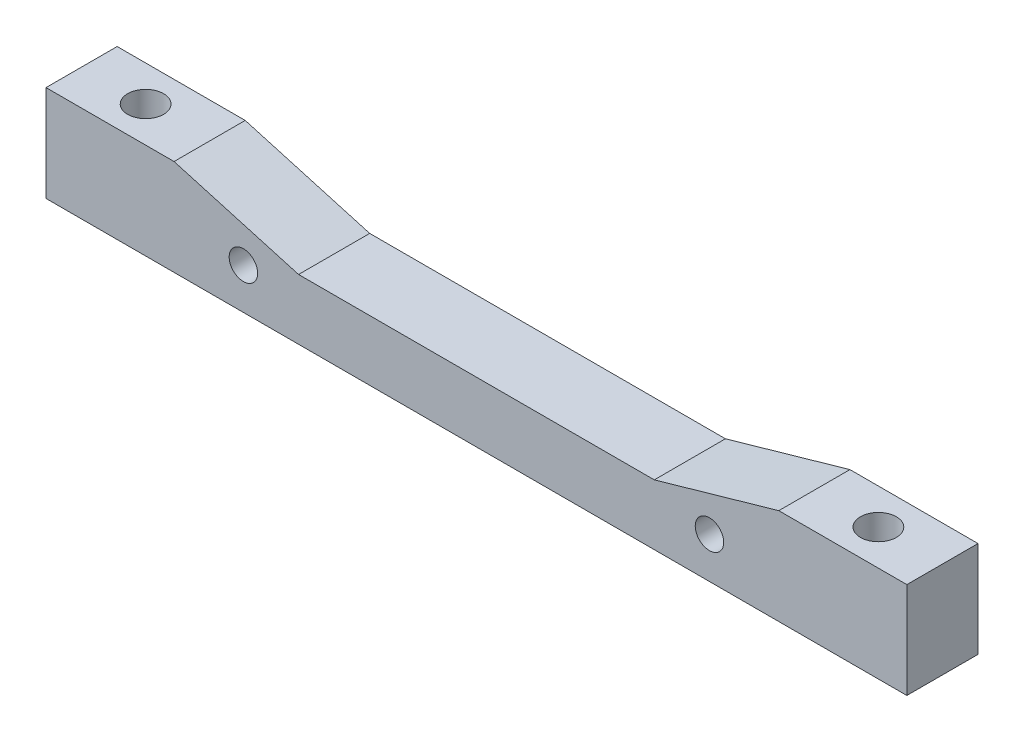
ISO-10303-21;
HEADER;
FILE_DESCRIPTION(('STEP AP214'),'2;1');
FILE_NAME('part.step','',(''),(''),'','','');
FILE_SCHEMA(('AUTOMOTIVE_DESIGN { 1 0 10303 214 1 1 1 1 }'));
ENDSEC;
DATA;
#1=APPLICATION_CONTEXT('core data for automotive mechanical design processes');
#2=APPLICATION_PROTOCOL_DEFINITION('international standard','automotive_design',2000,#1);
#3=PRODUCT_CONTEXT('',#1,'mechanical');
#4=PRODUCT('Part','Part','',(#3));
#5=PRODUCT_RELATED_PRODUCT_CATEGORY('part','',(#4));
#6=PRODUCT_DEFINITION_FORMATION('','',#4);
#7=PRODUCT_DEFINITION_CONTEXT('part definition',#1,'design');
#8=PRODUCT_DEFINITION('design','',#6,#7);
#9=PRODUCT_DEFINITION_SHAPE('','',#8);
#10=(LENGTH_UNIT() NAMED_UNIT(*) SI_UNIT(.MILLI.,.METRE.));
#11=(NAMED_UNIT(*) PLANE_ANGLE_UNIT() SI_UNIT($,.RADIAN.));
#12=(NAMED_UNIT(*) SI_UNIT($,.STERADIAN.) SOLID_ANGLE_UNIT());
#13=UNCERTAINTY_MEASURE_WITH_UNIT(LENGTH_MEASURE(1.E-05),#10,'distance_accuracy_value','');
#14=(GEOMETRIC_REPRESENTATION_CONTEXT(3) GLOBAL_UNCERTAINTY_ASSIGNED_CONTEXT((#13)) GLOBAL_UNIT_ASSIGNED_CONTEXT((#10,
#11,#12)) REPRESENTATION_CONTEXT('',''));
#15=CARTESIAN_POINT('',(0.,0.,0.));
#16=DIRECTION('',(0.,0.,1.));
#17=DIRECTION('',(1.,0.,0.));
#18=AXIS2_PLACEMENT_3D('',#15,#16,#17);
#19=CARTESIAN_POINT('',(0.,13.5,0.));
#20=DIRECTION('',(0.,-1.,0.));
#21=DIRECTION('',(0.,0.,-1.));
#22=AXIS2_PLACEMENT_3D('',#19,#20,#21);
#23=PLANE('',#22);
#24=CARTESIAN_POINT('',(9.,13.5,-5.));
#25=DIRECTION('',(0.,1.,0.));
#26=DIRECTION('',(0.,0.,1.));
#27=AXIS2_PLACEMENT_3D('',#24,#25,#26);
#28=CIRCLE('',#27,2.525);
#29=CARTESIAN_POINT('',(9.,13.5,-2.475));
#30=VERTEX_POINT('',#29);
#31=EDGE_CURVE('E157',#30,#30,#28,.T.);
#32=ORIENTED_EDGE('',*,*,#31,.F.);
#33=EDGE_LOOP('',(#32));
#34=FACE_BOUND('',#33,.T.);
#35=DIRECTION('',(1.,0.,0.));
#36=VECTOR('',#35,1.);
#37=CARTESIAN_POINT('',(0.,13.5,0.));
#38=LINE('',#37,#36);
#39=CARTESIAN_POINT('',(0.,13.5,0.));
#40=VERTEX_POINT('',#39);
#41=CARTESIAN_POINT('',(18.,13.5,0.));
#42=VERTEX_POINT('',#41);
#43=EDGE_CURVE('E96',#40,#42,#38,.T.);
#44=ORIENTED_EDGE('',*,*,#43,.T.);
#45=DIRECTION('',(0.,0.,-1.));
#46=VECTOR('',#45,1.);
#47=CARTESIAN_POINT('',(18.,13.5,0.));
#48=LINE('',#47,#46);
#49=CARTESIAN_POINT('',(18.,13.5,-10.));
#50=VERTEX_POINT('',#49);
#51=EDGE_CURVE('E49',#42,#50,#48,.T.);
#52=ORIENTED_EDGE('',*,*,#51,.T.);
#53=DIRECTION('',(-1.,0.,0.));
#54=VECTOR('',#53,1.);
#55=CARTESIAN_POINT('',(0.,13.5,-10.));
#56=LINE('',#55,#54);
#57=CARTESIAN_POINT('',(0.,13.5,-10.));
#58=VERTEX_POINT('',#57);
#59=EDGE_CURVE('E66',#50,#58,#56,.T.);
#60=ORIENTED_EDGE('',*,*,#59,.T.);
#61=DIRECTION('',(0.,0.,1.));
#62=VECTOR('',#61,1.);
#63=CARTESIAN_POINT('',(0.,13.5,0.));
#64=LINE('',#63,#62);
#65=EDGE_CURVE('E168',#58,#40,#64,.T.);
#66=ORIENTED_EDGE('',*,*,#65,.T.);
#67=EDGE_LOOP('',(#44,#52,#60,#66));
#68=FACE_BOUND('',#67,.T.);
#69=ADVANCED_FACE('F39',(#34,#68),#23,.F.);
#70=CARTESIAN_POINT('',(0.,13.5,0.));
#71=DIRECTION('',(1.,0.,0.));
#72=DIRECTION('',(0.,0.,-1.));
#73=AXIS2_PLACEMENT_3D('',#70,#71,#72);
#74=PLANE('',#73);
#75=DIRECTION('',(0.,0.,1.));
#76=VECTOR('',#75,1.);
#77=CARTESIAN_POINT('',(0.,0.,0.));
#78=LINE('',#77,#76);
#79=CARTESIAN_POINT('',(0.,0.,-10.));
#80=VERTEX_POINT('',#79);
#81=CARTESIAN_POINT('',(0.,0.,0.));
#82=VERTEX_POINT('',#81);
#83=EDGE_CURVE('E156',#80,#82,#78,.T.);
#84=ORIENTED_EDGE('',*,*,#83,.T.);
#85=DIRECTION('',(0.,-1.,0.));
#86=VECTOR('',#85,1.);
#87=CARTESIAN_POINT('',(0.,13.5,0.));
#88=LINE('',#87,#86);
#89=EDGE_CURVE('E202',#40,#82,#88,.T.);
#90=ORIENTED_EDGE('',*,*,#89,.F.);
#91=ORIENTED_EDGE('',*,*,#65,.F.);
#92=DIRECTION('',(0.,-1.,0.));
#93=VECTOR('',#92,1.);
#94=CARTESIAN_POINT('',(0.,13.5,-10.));
#95=LINE('',#94,#93);
#96=EDGE_CURVE('E181',#58,#80,#95,.T.);
#97=ORIENTED_EDGE('',*,*,#96,.T.);
#98=EDGE_LOOP('',(#84,#90,#91,#97));
#99=FACE_BOUND('',#98,.T.);
#100=ADVANCED_FACE('F41',(#99),#74,.F.);
#101=CARTESIAN_POINT('',(0.,13.5,0.));
#102=DIRECTION('',(0.,0.,-1.));
#103=DIRECTION('',(-1.,0.,0.));
#104=AXIS2_PLACEMENT_3D('',#101,#102,#103);
#105=PLANE('',#104);
#106=CARTESIAN_POINT('',(27.745,5.76,0.));
#107=DIRECTION('',(0.,0.,1.));
#108=DIRECTION('',(1.,0.,0.));
#109=AXIS2_PLACEMENT_3D('',#106,#107,#108);
#110=CIRCLE('',#109,2.);
#111=CARTESIAN_POINT('',(29.745,5.76,0.));
#112=VERTEX_POINT('',#111);
#113=EDGE_CURVE('E212',#112,#112,#110,.T.);
#114=ORIENTED_EDGE('',*,*,#113,.F.);
#115=EDGE_LOOP('',(#114));
#116=FACE_BOUND('',#115,.T.);
#117=CARTESIAN_POINT('',(93.255,5.76000000000001,0.));
#118=DIRECTION('',(0.,0.,1.));
#119=DIRECTION('',(-1.,0.,0.));
#120=AXIS2_PLACEMENT_3D('',#117,#118,#119);
#121=CIRCLE('',#120,2.00000000000001);
#122=CARTESIAN_POINT('',(91.255,5.76000000000001,0.));
#123=VERTEX_POINT('',#122);
#124=EDGE_CURVE('E219',#123,#123,#121,.T.);
#125=ORIENTED_EDGE('',*,*,#124,.F.);
#126=EDGE_LOOP('',(#125));
#127=FACE_BOUND('',#126,.T.);
#128=DIRECTION('',(1.,0.,0.));
#129=VECTOR('',#128,1.);
#130=CARTESIAN_POINT('',(85.5,8.50000000000002,0.));
#131=LINE('',#130,#129);
#132=CARTESIAN_POINT('',(35.5,8.50000000000001,0.));
#133=VERTEX_POINT('',#132);
#134=CARTESIAN_POINT('',(85.5,8.50000000000002,0.));
#135=VERTEX_POINT('',#134);
#136=EDGE_CURVE('E124',#133,#135,#131,.T.);
#137=ORIENTED_EDGE('',*,*,#136,.F.);
#138=DIRECTION('',(0.961523947640823,-0.274721127897378,0.));
#139=VECTOR('',#138,1.);
#140=CARTESIAN_POINT('',(18.,13.5,0.));
#141=LINE('',#140,#139);
#142=EDGE_CURVE('E130',#42,#133,#141,.T.);
#143=ORIENTED_EDGE('',*,*,#142,.F.);
#144=ORIENTED_EDGE('',*,*,#43,.F.);
#145=ORIENTED_EDGE('',*,*,#89,.T.);
#146=DIRECTION('',(1.,0.,0.));
#147=VECTOR('',#146,1.);
#148=CARTESIAN_POINT('',(0.,0.,0.));
#149=LINE('',#148,#147);
#150=CARTESIAN_POINT('',(121.,0.,0.));
#151=VERTEX_POINT('',#150);
#152=EDGE_CURVE('E185',#82,#151,#149,.T.);
#153=ORIENTED_EDGE('',*,*,#152,.T.);
#154=DIRECTION('',(0.,-1.,0.));
#155=VECTOR('',#154,1.);
#156=CARTESIAN_POINT('',(121.,13.5,0.));
#157=LINE('',#156,#155);
#158=CARTESIAN_POINT('',(121.,13.5,0.));
#159=VERTEX_POINT('',#158);
#160=EDGE_CURVE('E198',#159,#151,#157,.T.);
#161=ORIENTED_EDGE('',*,*,#160,.F.);
#162=CARTESIAN_POINT('',(103.,13.5,0.));
#163=VERTEX_POINT('',#162);
#164=EDGE_CURVE('E171',#163,#159,#38,.T.);
#165=ORIENTED_EDGE('',*,*,#164,.F.);
#166=DIRECTION('',(0.961523947640823,0.274721127897378,0.));
#167=VECTOR('',#166,1.);
#168=CARTESIAN_POINT('',(103.,13.5,0.));
#169=LINE('',#168,#167);
#170=EDGE_CURVE('E57',#135,#163,#169,.T.);
#171=ORIENTED_EDGE('',*,*,#170,.F.);
#172=EDGE_LOOP('',(#137,#143,#144,#145,#153,#161,#165,#171));
#173=FACE_BOUND('',#172,.T.);
#174=ADVANCED_FACE('F134',(#116,#127,#173),#105,.F.);
#175=CARTESIAN_POINT('',(121.,13.5,0.));
#176=DIRECTION('',(-1.,0.,0.));
#177=DIRECTION('',(0.,0.,1.));
#178=AXIS2_PLACEMENT_3D('',#175,#176,#177);
#179=PLANE('',#178);
#180=DIRECTION('',(0.,0.,-1.));
#181=VECTOR('',#180,1.);
#182=CARTESIAN_POINT('',(121.,0.,0.));
#183=LINE('',#182,#181);
#184=CARTESIAN_POINT('',(121.,0.,-10.));
#185=VERTEX_POINT('',#184);
#186=EDGE_CURVE('E188',#151,#185,#183,.T.);
#187=ORIENTED_EDGE('',*,*,#186,.T.);
#188=DIRECTION('',(0.,-1.,0.));
#189=VECTOR('',#188,1.);
#190=CARTESIAN_POINT('',(121.,13.5,-10.));
#191=LINE('',#190,#189);
#192=CARTESIAN_POINT('',(121.,13.5,-10.));
#193=VERTEX_POINT('',#192);
#194=EDGE_CURVE('E195',#193,#185,#191,.T.);
#195=ORIENTED_EDGE('',*,*,#194,.F.);
#196=DIRECTION('',(0.,0.,-1.));
#197=VECTOR('',#196,1.);
#198=CARTESIAN_POINT('',(121.,13.5,0.));
#199=LINE('',#198,#197);
#200=EDGE_CURVE('E174',#159,#193,#199,.T.);
#201=ORIENTED_EDGE('',*,*,#200,.F.);
#202=ORIENTED_EDGE('',*,*,#160,.T.);
#203=EDGE_LOOP('',(#187,#195,#201,#202));
#204=FACE_BOUND('',#203,.T.);
#205=ADVANCED_FACE('F231',(#204),#179,.F.);
#206=CARTESIAN_POINT('',(0.,13.5,-10.));
#207=DIRECTION('',(0.,0.,1.));
#208=DIRECTION('',(1.,0.,0.));
#209=AXIS2_PLACEMENT_3D('',#206,#207,#208);
#210=PLANE('',#209);
#211=CARTESIAN_POINT('',(27.745,5.76,-10.));
#212=DIRECTION('',(0.,0.,1.));
#213=DIRECTION('',(1.,0.,0.));
#214=AXIS2_PLACEMENT_3D('',#211,#212,#213);
#215=CIRCLE('',#214,2.);
#216=CARTESIAN_POINT('',(29.745,5.76,-10.));
#217=VERTEX_POINT('',#216);
#218=EDGE_CURVE('E43',#217,#217,#215,.T.);
#219=ORIENTED_EDGE('',*,*,#218,.T.);
#220=EDGE_LOOP('',(#219));
#221=FACE_BOUND('',#220,.T.);
#222=CARTESIAN_POINT('',(93.255,5.76000000000001,-10.));
#223=DIRECTION('',(0.,0.,1.));
#224=DIRECTION('',(1.,0.,0.));
#225=AXIS2_PLACEMENT_3D('',#222,#223,#224);
#226=CIRCLE('',#225,2.00000000000001);
#227=CARTESIAN_POINT('',(95.255,5.76000000000001,-10.));
#228=VERTEX_POINT('',#227);
#229=EDGE_CURVE('E209',#228,#228,#226,.T.);
#230=ORIENTED_EDGE('',*,*,#229,.T.);
#231=EDGE_LOOP('',(#230));
#232=FACE_BOUND('',#231,.T.);
#233=ORIENTED_EDGE('',*,*,#59,.F.);
#234=DIRECTION('',(0.961523947640823,-0.274721127897378,0.));
#235=VECTOR('',#234,1.);
#236=CARTESIAN_POINT('',(1.35849056603773,18.2547169811321,-10.));
#237=LINE('',#236,#235);
#238=CARTESIAN_POINT('',(35.5,8.50000000000001,-10.));
#239=VERTEX_POINT('',#238);
#240=EDGE_CURVE('E148',#50,#239,#237,.T.);
#241=ORIENTED_EDGE('',*,*,#240,.T.);
#242=DIRECTION('',(1.,0.,0.));
#243=VECTOR('',#242,1.);
#244=CARTESIAN_POINT('',(0.,8.50000000000001,-10.));
#245=LINE('',#244,#243);
#246=CARTESIAN_POINT('',(85.5,8.50000000000002,-10.));
#247=VERTEX_POINT('',#246);
#248=EDGE_CURVE('E11',#239,#247,#245,.T.);
#249=ORIENTED_EDGE('',*,*,#248,.T.);
#250=DIRECTION('',(0.961523947640823,0.274721127897378,0.));
#251=VECTOR('',#250,1.);
#252=CARTESIAN_POINT('',(7.77358490566034,-13.7075471698113,-10.));
#253=LINE('',#252,#251);
#254=CARTESIAN_POINT('',(103.,13.5,-10.));
#255=VERTEX_POINT('',#254);
#256=EDGE_CURVE('E143',#247,#255,#253,.T.);
#257=ORIENTED_EDGE('',*,*,#256,.T.);
#258=EDGE_CURVE('E177',#193,#255,#56,.T.);
#259=ORIENTED_EDGE('',*,*,#258,.F.);
#260=ORIENTED_EDGE('',*,*,#194,.T.);
#261=DIRECTION('',(-1.,0.,0.));
#262=VECTOR('',#261,1.);
#263=CARTESIAN_POINT('',(0.,0.,-10.));
#264=LINE('',#263,#262);
#265=EDGE_CURVE('E88',#185,#80,#264,.T.);
#266=ORIENTED_EDGE('',*,*,#265,.T.);
#267=ORIENTED_EDGE('',*,*,#96,.F.);
#268=EDGE_LOOP('',(#233,#241,#249,#257,#259,#260,#266,#267));
#269=FACE_BOUND('',#268,.T.);
#270=ADVANCED_FACE('F237',(#221,#232,#269),#210,.F.);
#271=CARTESIAN_POINT('',(112.,13.5,-5.00000000000001));
#272=DIRECTION('',(0.,1.,0.));
#273=DIRECTION('',(0.,0.,-1.));
#274=AXIS2_PLACEMENT_3D('',#271,#272,#273);
#275=CIRCLE('',#274,2.52499999999999);
#276=CARTESIAN_POINT('',(112.,13.5,-7.52500000000001));
#277=VERTEX_POINT('',#276);
#278=EDGE_CURVE('E151',#277,#277,#275,.T.);
#279=ORIENTED_EDGE('',*,*,#278,.F.);
#280=EDGE_LOOP('',(#279));
#281=FACE_BOUND('',#280,.T.);
#282=ORIENTED_EDGE('',*,*,#258,.T.);
#283=DIRECTION('',(0.,0.,1.));
#284=VECTOR('',#283,1.);
#285=CARTESIAN_POINT('',(103.,13.5,0.));
#286=LINE('',#285,#284);
#287=EDGE_CURVE('E205',#255,#163,#286,.T.);
#288=ORIENTED_EDGE('',*,*,#287,.T.);
#289=ORIENTED_EDGE('',*,*,#164,.T.);
#290=ORIENTED_EDGE('',*,*,#200,.T.);
#291=EDGE_LOOP('',(#282,#288,#289,#290));
#292=FACE_BOUND('',#291,.T.);
#293=ADVANCED_FACE('F244',(#281,#292),#23,.F.);
#294=CARTESIAN_POINT('',(0.,0.,0.));
#295=DIRECTION('',(0.,-1.,0.));
#296=DIRECTION('',(0.,0.,-1.));
#297=AXIS2_PLACEMENT_3D('',#294,#295,#296);
#298=PLANE('',#297);
#299=ORIENTED_EDGE('',*,*,#83,.F.);
#300=ORIENTED_EDGE('',*,*,#265,.F.);
#301=ORIENTED_EDGE('',*,*,#186,.F.);
#302=ORIENTED_EDGE('',*,*,#152,.F.);
#303=EDGE_LOOP('',(#299,#300,#301,#302));
#304=FACE_BOUND('',#303,.T.);
#305=ADVANCED_FACE('F251',(#304),#298,.T.);
#306=CARTESIAN_POINT('',(112.,5.45,-5.00000000000001));
#307=DIRECTION('',(0.,1.,0.));
#308=DIRECTION('',(0.,0.,1.));
#309=AXIS2_PLACEMENT_3D('',#306,#307,#308);
#310=CYLINDRICAL_SURFACE('',#309,2.52499999999999);
#311=CARTESIAN_POINT('',(112.,5.45,-5.00000000000001));
#312=DIRECTION('',(0.,1.,0.));
#313=DIRECTION('',(0.,0.,-1.));
#314=AXIS2_PLACEMENT_3D('',#311,#312,#313);
#315=CIRCLE('',#314,2.52499999999999);
#316=CARTESIAN_POINT('',(112.,5.45,-7.52500000000001));
#317=VERTEX_POINT('',#316);
#318=EDGE_CURVE('E161',#317,#317,#315,.T.);
#319=ORIENTED_EDGE('',*,*,#318,.F.);
#320=EDGE_LOOP('',(#319));
#321=FACE_BOUND('',#320,.T.);
#322=ORIENTED_EDGE('',*,*,#278,.T.);
#323=EDGE_LOOP('',(#322));
#324=FACE_BOUND('',#323,.T.);
#325=ADVANCED_FACE('F257',(#321,#324),#310,.F.);
#326=CARTESIAN_POINT('',(112.,5.45,-5.00000000000001));
#327=DIRECTION('',(0.,-1.,0.));
#328=DIRECTION('',(0.,0.,-1.));
#329=AXIS2_PLACEMENT_3D('',#326,#327,#328);
#330=PLANE('',#329);
#331=ORIENTED_EDGE('',*,*,#318,.T.);
#332=EDGE_LOOP('',(#331));
#333=FACE_BOUND('',#332,.T.);
#334=ADVANCED_FACE('F287',(#333),#330,.F.);
#335=CARTESIAN_POINT('',(9.,5.45,-5.));
#336=DIRECTION('',(0.,1.,0.));
#337=DIRECTION('',(0.,0.,1.));
#338=AXIS2_PLACEMENT_3D('',#335,#336,#337);
#339=CYLINDRICAL_SURFACE('',#338,2.525);
#340=CARTESIAN_POINT('',(9.,5.45,-5.));
#341=DIRECTION('',(0.,1.,0.));
#342=DIRECTION('',(0.,0.,1.));
#343=AXIS2_PLACEMENT_3D('',#340,#341,#342);
#344=CIRCLE('',#343,2.525);
#345=CARTESIAN_POINT('',(9.,5.45,-2.475));
#346=VERTEX_POINT('',#345);
#347=EDGE_CURVE('E152',#346,#346,#344,.T.);
#348=ORIENTED_EDGE('',*,*,#347,.F.);
#349=EDGE_LOOP('',(#348));
#350=FACE_BOUND('',#349,.T.);
#351=ORIENTED_EDGE('',*,*,#31,.T.);
#352=EDGE_LOOP('',(#351));
#353=FACE_BOUND('',#352,.T.);
#354=ADVANCED_FACE('F283',(#350,#353),#339,.F.);
#355=CARTESIAN_POINT('',(9.,5.45,-5.));
#356=DIRECTION('',(0.,1.,0.));
#357=DIRECTION('',(0.,0.,1.));
#358=AXIS2_PLACEMENT_3D('',#355,#356,#357);
#359=PLANE('',#358);
#360=ORIENTED_EDGE('',*,*,#347,.T.);
#361=EDGE_LOOP('',(#360));
#362=FACE_BOUND('',#361,.T.);
#363=ADVANCED_FACE('F279',(#362),#359,.T.);
#364=CARTESIAN_POINT('',(85.5,8.50000000000002,-20.));
#365=DIRECTION('',(0.,-1.,0.));
#366=DIRECTION('',(1.,0.,0.));
#367=AXIS2_PLACEMENT_3D('',#364,#365,#366);
#368=PLANE('',#367);
#369=DIRECTION('',(0.,0.,1.));
#370=VECTOR('',#369,1.);
#371=CARTESIAN_POINT('',(35.5,8.50000000000001,-20.));
#372=LINE('',#371,#370);
#373=EDGE_CURVE('E119',#239,#133,#372,.T.);
#374=ORIENTED_EDGE('',*,*,#373,.T.);
#375=ORIENTED_EDGE('',*,*,#136,.T.);
#376=DIRECTION('',(0.,0.,1.));
#377=VECTOR('',#376,1.);
#378=CARTESIAN_POINT('',(85.5,8.50000000000002,-20.));
#379=LINE('',#378,#377);
#380=EDGE_CURVE('E128',#247,#135,#379,.T.);
#381=ORIENTED_EDGE('',*,*,#380,.F.);
#382=ORIENTED_EDGE('',*,*,#248,.F.);
#383=EDGE_LOOP('',(#374,#375,#381,#382));
#384=FACE_BOUND('',#383,.T.);
#385=ADVANCED_FACE('F121',(#384),#368,.F.);
#386=CARTESIAN_POINT('',(18.,13.5,-20.));
#387=DIRECTION('',(-0.274721127897378,-0.961523947640823,0.));
#388=DIRECTION('',(0.961523947640823,-0.274721127897378,0.));
#389=AXIS2_PLACEMENT_3D('',#386,#387,#388);
#390=PLANE('',#389);
#391=ORIENTED_EDGE('',*,*,#51,.F.);
#392=ORIENTED_EDGE('',*,*,#142,.T.);
#393=ORIENTED_EDGE('',*,*,#373,.F.);
#394=ORIENTED_EDGE('',*,*,#240,.F.);
#395=EDGE_LOOP('',(#391,#392,#393,#394));
#396=FACE_BOUND('',#395,.T.);
#397=ADVANCED_FACE('F131',(#396),#390,.F.);
#398=CARTESIAN_POINT('',(103.,13.5,-20.));
#399=DIRECTION('',(0.274721127897378,-0.961523947640823,0.));
#400=DIRECTION('',(0.961523947640823,0.274721127897378,0.));
#401=AXIS2_PLACEMENT_3D('',#398,#399,#400);
#402=PLANE('',#401);
#403=ORIENTED_EDGE('',*,*,#380,.T.);
#404=ORIENTED_EDGE('',*,*,#170,.T.);
#405=ORIENTED_EDGE('',*,*,#287,.F.);
#406=ORIENTED_EDGE('',*,*,#256,.F.);
#407=EDGE_LOOP('',(#403,#404,#405,#406));
#408=FACE_BOUND('',#407,.T.);
#409=ADVANCED_FACE('F266',(#408),#402,.F.);
#410=CARTESIAN_POINT('',(93.255,5.76000000000001,-20.));
#411=DIRECTION('',(0.,0.,1.));
#412=DIRECTION('',(1.,0.,0.));
#413=AXIS2_PLACEMENT_3D('',#410,#411,#412);
#414=CYLINDRICAL_SURFACE('',#413,2.00000000000001);
#415=ORIENTED_EDGE('',*,*,#124,.T.);
#416=EDGE_LOOP('',(#415));
#417=FACE_BOUND('',#416,.T.);
#418=ORIENTED_EDGE('',*,*,#229,.F.);
#419=EDGE_LOOP('',(#418));
#420=FACE_BOUND('',#419,.T.);
#421=ADVANCED_FACE('F227',(#417,#420),#414,.F.);
#422=CARTESIAN_POINT('',(27.745,5.76,-20.));
#423=DIRECTION('',(0.,0.,1.));
#424=DIRECTION('',(1.,0.,0.));
#425=AXIS2_PLACEMENT_3D('',#422,#423,#424);
#426=CYLINDRICAL_SURFACE('',#425,2.);
#427=ORIENTED_EDGE('',*,*,#113,.T.);
#428=EDGE_LOOP('',(#427));
#429=FACE_BOUND('',#428,.T.);
#430=ORIENTED_EDGE('',*,*,#218,.F.);
#431=EDGE_LOOP('',(#430));
#432=FACE_BOUND('',#431,.T.);
#433=ADVANCED_FACE('F273',(#429,#432),#426,.F.);
#434=CLOSED_SHELL('',(#69,#100,#174,#205,#270,#293,#305,#325,#334,#354,#363,#385,#397,#409,#421,#433));
#435=MANIFOLD_SOLID_BREP('B2',#434);
#436=ADVANCED_BREP_SHAPE_REPRESENTATION('',(#18,#435),#14);
#437=SHAPE_DEFINITION_REPRESENTATION(#9,#436);
ENDSEC;
END-ISO-10303-21;
